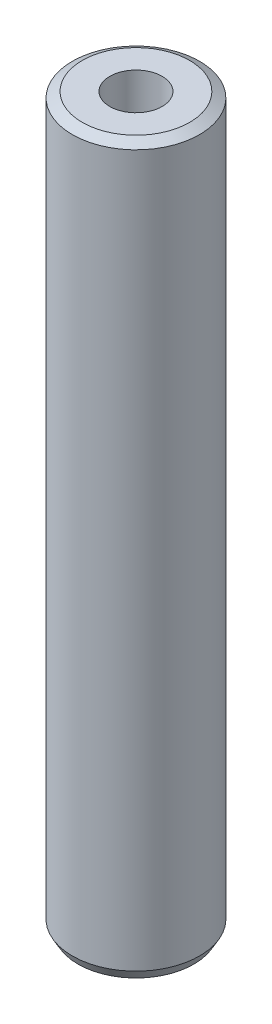
ISO-10303-21;
HEADER;
FILE_DESCRIPTION(('STEP AP214'),'2;1');
FILE_NAME('part.step','',(''),(''),'','','');
FILE_SCHEMA(('AUTOMOTIVE_DESIGN { 1 0 10303 214 1 1 1 1 }'));
ENDSEC;
DATA;
#1=APPLICATION_CONTEXT('core data for automotive mechanical design processes');
#2=APPLICATION_PROTOCOL_DEFINITION('international standard','automotive_design',2000,#1);
#3=PRODUCT_CONTEXT('',#1,'mechanical');
#4=PRODUCT('Part','Part','',(#3));
#5=PRODUCT_RELATED_PRODUCT_CATEGORY('part','',(#4));
#6=PRODUCT_DEFINITION_FORMATION('','',#4);
#7=PRODUCT_DEFINITION_CONTEXT('part definition',#1,'design');
#8=PRODUCT_DEFINITION('design','',#6,#7);
#9=PRODUCT_DEFINITION_SHAPE('','',#8);
#10=(LENGTH_UNIT() NAMED_UNIT(*) SI_UNIT(.MILLI.,.METRE.));
#11=(NAMED_UNIT(*) PLANE_ANGLE_UNIT() SI_UNIT($,.RADIAN.));
#12=(NAMED_UNIT(*) SI_UNIT($,.STERADIAN.) SOLID_ANGLE_UNIT());
#13=UNCERTAINTY_MEASURE_WITH_UNIT(LENGTH_MEASURE(1.E-05),#10,'distance_accuracy_value','');
#14=(GEOMETRIC_REPRESENTATION_CONTEXT(3) GLOBAL_UNCERTAINTY_ASSIGNED_CONTEXT((#13)) GLOBAL_UNIT_ASSIGNED_CONTEXT((#10,
#11,#12)) REPRESENTATION_CONTEXT('',''));
#15=CARTESIAN_POINT('',(0.,0.,0.));
#16=DIRECTION('',(0.,0.,1.));
#17=DIRECTION('',(1.,0.,0.));
#18=AXIS2_PLACEMENT_3D('',#15,#16,#17);
#19=CARTESIAN_POINT('',(0.,600.,0.));
#20=DIRECTION('',(0.,-1.,0.));
#21=DIRECTION('',(0.,0.,-1.));
#22=AXIS2_PLACEMENT_3D('',#19,#20,#21);
#23=CYLINDRICAL_SURFACE('',#22,52.5);
#24=CARTESIAN_POINT('',(0.,595.34357921984,0.));
#25=DIRECTION('',(0.,1.,0.));
#26=DIRECTION('',(0.,0.,1.));
#27=AXIS2_PLACEMENT_3D('',#24,#25,#26);
#28=CIRCLE('',#27,52.5);
#29=CARTESIAN_POINT('',(0.,595.34357921984,52.5));
#30=VERTEX_POINT('',#29);
#31=EDGE_CURVE('E50',#30,#30,#28,.F.);
#32=ORIENTED_EDGE('',*,*,#31,.T.);
#33=EDGE_LOOP('',(#32));
#34=FACE_BOUND('',#33,.T.);
#35=CARTESIAN_POINT('',(0.,8.18466002459528,0.));
#36=DIRECTION('',(0.,1.,0.));
#37=DIRECTION('',(0.,0.,1.));
#38=AXIS2_PLACEMENT_3D('',#35,#36,#37);
#39=CIRCLE('',#38,52.5);
#40=CARTESIAN_POINT('',(0.,8.18466002459528,52.5));
#41=VERTEX_POINT('',#40);
#42=EDGE_CURVE('E51',#41,#41,#39,.T.);
#43=ORIENTED_EDGE('',*,*,#42,.T.);
#44=EDGE_LOOP('',(#43));
#45=FACE_BOUND('',#44,.T.);
#46=ADVANCED_FACE('F39',(#34,#45),#23,.T.);
#47=CARTESIAN_POINT('',(0.,600.,0.));
#48=DIRECTION('',(0.,1.,0.));
#49=DIRECTION('',(0.,0.,1.));
#50=AXIS2_PLACEMENT_3D('',#47,#48,#49);
#51=PLANE('',#50);
#52=CARTESIAN_POINT('',(0.,600.,0.));
#53=DIRECTION('',(0.,1.,0.));
#54=DIRECTION('',(0.,0.,1.));
#55=AXIS2_PLACEMENT_3D('',#52,#53,#54);
#56=CIRCLE('',#55,44.315339975405);
#57=CARTESIAN_POINT('',(0.,600.,44.315339975405));
#58=VERTEX_POINT('',#57);
#59=EDGE_CURVE('E54',#58,#58,#56,.T.);
#60=ORIENTED_EDGE('',*,*,#59,.T.);
#61=EDGE_LOOP('',(#60));
#62=FACE_BOUND('',#61,.T.);
#63=CARTESIAN_POINT('',(0.,600.,0.));
#64=DIRECTION('',(0.,1.,0.));
#65=DIRECTION('',(0.,0.,1.));
#66=AXIS2_PLACEMENT_3D('',#63,#64,#65);
#67=CIRCLE('',#66,21.6080967801979);
#68=CARTESIAN_POINT('',(0.,600.,21.6080967801979));
#69=VERTEX_POINT('',#68);
#70=EDGE_CURVE('E58',#69,#69,#67,.T.);
#71=ORIENTED_EDGE('',*,*,#70,.F.);
#72=EDGE_LOOP('',(#71));
#73=FACE_BOUND('',#72,.T.);
#74=ADVANCED_FACE('F69',(#62,#73),#51,.T.);
#75=CARTESIAN_POINT('',(0.,0.,0.));
#76=DIRECTION('',(0.,1.,0.));
#77=DIRECTION('',(0.,0.,1.));
#78=AXIS2_PLACEMENT_3D('',#75,#76,#77);
#79=PLANE('',#78);
#80=CARTESIAN_POINT('',(0.,0.,0.));
#81=DIRECTION('',(0.,1.,0.));
#82=DIRECTION('',(0.,0.,1.));
#83=AXIS2_PLACEMENT_3D('',#80,#81,#82);
#84=CIRCLE('',#83,47.8435792198403);
#85=CARTESIAN_POINT('',(0.,0.,47.8435792198403));
#86=VERTEX_POINT('',#85);
#87=EDGE_CURVE('E10',#86,#86,#84,.F.);
#88=ORIENTED_EDGE('',*,*,#87,.T.);
#89=EDGE_LOOP('',(#88));
#90=FACE_BOUND('',#89,.T.);
#91=CARTESIAN_POINT('',(0.,0.,0.));
#92=DIRECTION('',(0.,1.,0.));
#93=DIRECTION('',(0.,0.,1.));
#94=AXIS2_PLACEMENT_3D('',#91,#92,#93);
#95=CIRCLE('',#94,21.6080967801979);
#96=CARTESIAN_POINT('',(0.,0.,21.6080967801979));
#97=VERTEX_POINT('',#96);
#98=EDGE_CURVE('E63',#97,#97,#95,.T.);
#99=ORIENTED_EDGE('',*,*,#98,.T.);
#100=EDGE_LOOP('',(#99));
#101=FACE_BOUND('',#100,.T.);
#102=ADVANCED_FACE('F75',(#90,#101),#79,.F.);
#103=CARTESIAN_POINT('',(0.,600.,0.));
#104=DIRECTION('',(0.,-1.,0.));
#105=DIRECTION('',(0.,0.,-1.));
#106=AXIS2_PLACEMENT_3D('',#103,#104,#105);
#107=CYLINDRICAL_SURFACE('',#106,21.6080967801979);
#108=ORIENTED_EDGE('',*,*,#70,.T.);
#109=EDGE_LOOP('',(#108));
#110=FACE_BOUND('',#109,.T.);
#111=ORIENTED_EDGE('',*,*,#98,.F.);
#112=EDGE_LOOP('',(#111));
#113=FACE_BOUND('',#112,.T.);
#114=ADVANCED_FACE('F70',(#110,#113),#107,.F.);
#115=CARTESIAN_POINT('',(0.,600.,0.));
#116=DIRECTION('',(0.,-1.,0.));
#117=DIRECTION('',(0.,0.,-1.));
#118=AXIS2_PLACEMENT_3D('',#115,#116,#117);
#119=CONICAL_SURFACE('',#118,44.315339975405,1.0535429638275);
#120=ORIENTED_EDGE('',*,*,#31,.F.);
#121=EDGE_LOOP('',(#120));
#122=FACE_BOUND('',#121,.T.);
#123=ORIENTED_EDGE('',*,*,#59,.F.);
#124=EDGE_LOOP('',(#123));
#125=FACE_BOUND('',#124,.T.);
#126=ADVANCED_FACE('F81',(#122,#125),#119,.T.);
#127=CARTESIAN_POINT('',(0.,8.18466002459528,0.));
#128=DIRECTION('',(0.,1.,0.));
#129=DIRECTION('',(0.,0.,1.));
#130=AXIS2_PLACEMENT_3D('',#127,#128,#129);
#131=CONICAL_SURFACE('',#130,52.5,0.517253362967386);
#132=ORIENTED_EDGE('',*,*,#87,.F.);
#133=EDGE_LOOP('',(#132));
#134=FACE_BOUND('',#133,.T.);
#135=ORIENTED_EDGE('',*,*,#42,.F.);
#136=EDGE_LOOP('',(#135));
#137=FACE_BOUND('',#136,.T.);
#138=ADVANCED_FACE('F45',(#134,#137),#131,.T.);
#139=CLOSED_SHELL('',(#46,#74,#102,#114,#126,#138));
#140=MANIFOLD_SOLID_BREP('B2',#139);
#141=ADVANCED_BREP_SHAPE_REPRESENTATION('',(#18,#140),#14);
#142=SHAPE_DEFINITION_REPRESENTATION(#9,#141);
ENDSEC;
END-ISO-10303-21;
